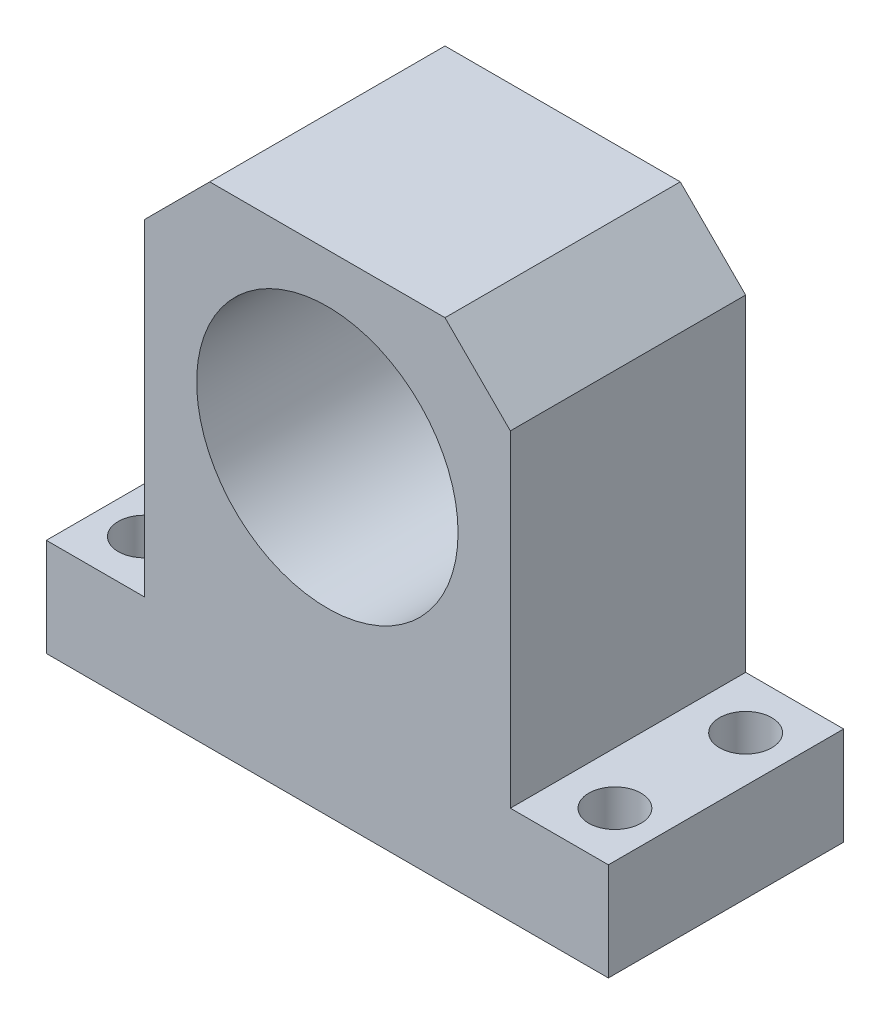
ISO-10303-21;
HEADER;
FILE_DESCRIPTION(('STEP AP214'),'2;1');
FILE_NAME('part.step','',(''),(''),'','','');
FILE_SCHEMA(('AUTOMOTIVE_DESIGN { 1 0 10303 214 1 1 1 1 }'));
ENDSEC;
DATA;
#1=APPLICATION_CONTEXT('core data for automotive mechanical design processes');
#2=APPLICATION_PROTOCOL_DEFINITION('international standard','automotive_design',2000,#1);
#3=PRODUCT_CONTEXT('',#1,'mechanical');
#4=PRODUCT('Part','Part','',(#3));
#5=PRODUCT_RELATED_PRODUCT_CATEGORY('part','',(#4));
#6=PRODUCT_DEFINITION_FORMATION('','',#4);
#7=PRODUCT_DEFINITION_CONTEXT('part definition',#1,'design');
#8=PRODUCT_DEFINITION('design','',#6,#7);
#9=PRODUCT_DEFINITION_SHAPE('','',#8);
#10=(LENGTH_UNIT() NAMED_UNIT(*) SI_UNIT(.MILLI.,.METRE.));
#11=(NAMED_UNIT(*) PLANE_ANGLE_UNIT() SI_UNIT($,.RADIAN.));
#12=(NAMED_UNIT(*) SI_UNIT($,.STERADIAN.) SOLID_ANGLE_UNIT());
#13=UNCERTAINTY_MEASURE_WITH_UNIT(LENGTH_MEASURE(1.E-05),#10,'distance_accuracy_value','');
#14=(GEOMETRIC_REPRESENTATION_CONTEXT(3) GLOBAL_UNCERTAINTY_ASSIGNED_CONTEXT((#13)) GLOBAL_UNIT_ASSIGNED_CONTEXT((#10,
#11,#12)) REPRESENTATION_CONTEXT('',''));
#15=CARTESIAN_POINT('',(0.,0.,0.));
#16=DIRECTION('',(0.,0.,1.));
#17=DIRECTION('',(1.,0.,0.));
#18=AXIS2_PLACEMENT_3D('',#15,#16,#17);
#19=CARTESIAN_POINT('',(0.,15.,36.));
#20=DIRECTION('',(1.,0.,0.));
#21=DIRECTION('',(0.,1.,0.));
#22=AXIS2_PLACEMENT_3D('',#19,#20,#21);
#23=PLANE('',#22);
#24=DIRECTION('',(0.,-1.,0.));
#25=VECTOR('',#24,1.);
#26=CARTESIAN_POINT('',(0.,15.,0.));
#27=LINE('',#26,#25);
#28=CARTESIAN_POINT('',(0.,15.,0.));
#29=VERTEX_POINT('',#28);
#30=CARTESIAN_POINT('',(0.,0.,0.));
#31=VERTEX_POINT('',#30);
#32=EDGE_CURVE('E135',#29,#31,#27,.T.);
#33=ORIENTED_EDGE('',*,*,#32,.T.);
#34=DIRECTION('',(0.,0.,-1.));
#35=VECTOR('',#34,1.);
#36=CARTESIAN_POINT('',(0.,0.,36.));
#37=LINE('',#36,#35);
#38=CARTESIAN_POINT('',(0.,0.,36.));
#39=VERTEX_POINT('',#38);
#40=EDGE_CURVE('E117',#39,#31,#37,.T.);
#41=ORIENTED_EDGE('',*,*,#40,.F.);
#42=DIRECTION('',(0.,-1.,0.));
#43=VECTOR('',#42,1.);
#44=CARTESIAN_POINT('',(0.,15.,36.));
#45=LINE('',#44,#43);
#46=CARTESIAN_POINT('',(0.,15.,36.));
#47=VERTEX_POINT('',#46);
#48=EDGE_CURVE('E123',#47,#39,#45,.T.);
#49=ORIENTED_EDGE('',*,*,#48,.F.);
#50=DIRECTION('',(0.,0.,-1.));
#51=VECTOR('',#50,1.);
#52=CARTESIAN_POINT('',(0.,15.,36.));
#53=LINE('',#52,#51);
#54=EDGE_CURVE('E185',#47,#29,#53,.T.);
#55=ORIENTED_EDGE('',*,*,#54,.T.);
#56=EDGE_LOOP('',(#33,#41,#49,#55));
#57=FACE_BOUND('',#56,.T.);
#58=ADVANCED_FACE('F33',(#57),#23,.F.);
#59=CARTESIAN_POINT('',(0.,0.,36.));
#60=DIRECTION('',(0.,1.,0.));
#61=DIRECTION('',(0.,0.,1.));
#62=AXIS2_PLACEMENT_3D('',#59,#60,#61);
#63=PLANE('',#62);
#64=CARTESIAN_POINT('',(6.99999999999999,0.,8.));
#65=DIRECTION('',(0.,1.,0.));
#66=DIRECTION('',(0.,0.,1.));
#67=AXIS2_PLACEMENT_3D('',#64,#65,#66);
#68=CIRCLE('',#67,4.);
#69=CARTESIAN_POINT('',(6.99999999999999,0.,12.));
#70=VERTEX_POINT('',#69);
#71=EDGE_CURVE('E219',#70,#70,#68,.T.);
#72=ORIENTED_EDGE('',*,*,#71,.T.);
#73=EDGE_LOOP('',(#72));
#74=FACE_BOUND('',#73,.T.);
#75=CARTESIAN_POINT('',(79.,0.,28.));
#76=DIRECTION('',(0.,1.,0.));
#77=DIRECTION('',(0.,0.,1.));
#78=AXIS2_PLACEMENT_3D('',#75,#76,#77);
#79=CIRCLE('',#78,4.00000000000001);
#80=CARTESIAN_POINT('',(79.,0.,32.));
#81=VERTEX_POINT('',#80);
#82=EDGE_CURVE('E211',#81,#81,#79,.T.);
#83=ORIENTED_EDGE('',*,*,#82,.T.);
#84=EDGE_LOOP('',(#83));
#85=FACE_BOUND('',#84,.T.);
#86=CARTESIAN_POINT('',(6.99999999999999,0.,28.));
#87=DIRECTION('',(0.,1.,0.));
#88=DIRECTION('',(0.,0.,1.));
#89=AXIS2_PLACEMENT_3D('',#86,#87,#88);
#90=CIRCLE('',#89,4.);
#91=CARTESIAN_POINT('',(6.99999999999999,0.,32.));
#92=VERTEX_POINT('',#91);
#93=EDGE_CURVE('E222',#92,#92,#90,.T.);
#94=ORIENTED_EDGE('',*,*,#93,.T.);
#95=EDGE_LOOP('',(#94));
#96=FACE_BOUND('',#95,.T.);
#97=CARTESIAN_POINT('',(79.,0.,8.));
#98=DIRECTION('',(0.,1.,0.));
#99=DIRECTION('',(0.,0.,1.));
#100=AXIS2_PLACEMENT_3D('',#97,#98,#99);
#101=CIRCLE('',#100,4.00000000000001);
#102=CARTESIAN_POINT('',(79.,0.,12.));
#103=VERTEX_POINT('',#102);
#104=EDGE_CURVE('E216',#103,#103,#101,.T.);
#105=ORIENTED_EDGE('',*,*,#104,.T.);
#106=EDGE_LOOP('',(#105));
#107=FACE_BOUND('',#106,.T.);
#108=DIRECTION('',(1.,0.,0.));
#109=VECTOR('',#108,1.);
#110=CARTESIAN_POINT('',(0.,0.,0.));
#111=LINE('',#110,#109);
#112=CARTESIAN_POINT('',(86.,0.,0.));
#113=VERTEX_POINT('',#112);
#114=EDGE_CURVE('E198',#31,#113,#111,.T.);
#115=ORIENTED_EDGE('',*,*,#114,.T.);
#116=DIRECTION('',(0.,0.,-1.));
#117=VECTOR('',#116,1.);
#118=CARTESIAN_POINT('',(86.,0.,36.));
#119=LINE('',#118,#117);
#120=CARTESIAN_POINT('',(86.,0.,36.));
#121=VERTEX_POINT('',#120);
#122=EDGE_CURVE('E120',#121,#113,#119,.T.);
#123=ORIENTED_EDGE('',*,*,#122,.F.);
#124=DIRECTION('',(1.,0.,0.));
#125=VECTOR('',#124,1.);
#126=CARTESIAN_POINT('',(0.,0.,36.));
#127=LINE('',#126,#125);
#128=EDGE_CURVE('E113',#39,#121,#127,.T.);
#129=ORIENTED_EDGE('',*,*,#128,.F.);
#130=ORIENTED_EDGE('',*,*,#40,.T.);
#131=EDGE_LOOP('',(#115,#123,#129,#130));
#132=FACE_BOUND('',#131,.T.);
#133=ADVANCED_FACE('F115',(#74,#85,#96,#107,#132),#63,.F.);
#134=CARTESIAN_POINT('',(86.,0.,36.));
#135=DIRECTION('',(-1.,0.,0.));
#136=DIRECTION('',(0.,0.,1.));
#137=AXIS2_PLACEMENT_3D('',#134,#135,#136);
#138=PLANE('',#137);
#139=DIRECTION('',(0.,1.,0.));
#140=VECTOR('',#139,1.);
#141=CARTESIAN_POINT('',(86.,0.,0.));
#142=LINE('',#141,#140);
#143=CARTESIAN_POINT('',(86.,15.,0.));
#144=VERTEX_POINT('',#143);
#145=EDGE_CURVE('E179',#113,#144,#142,.T.);
#146=ORIENTED_EDGE('',*,*,#145,.T.);
#147=DIRECTION('',(0.,0.,-1.));
#148=VECTOR('',#147,1.);
#149=CARTESIAN_POINT('',(86.,15.,36.));
#150=LINE('',#149,#148);
#151=CARTESIAN_POINT('',(86.,15.,36.));
#152=VERTEX_POINT('',#151);
#153=EDGE_CURVE('E140',#152,#144,#150,.T.);
#154=ORIENTED_EDGE('',*,*,#153,.F.);
#155=DIRECTION('',(0.,1.,0.));
#156=VECTOR('',#155,1.);
#157=CARTESIAN_POINT('',(86.,0.,36.));
#158=LINE('',#157,#156);
#159=EDGE_CURVE('E122',#121,#152,#158,.T.);
#160=ORIENTED_EDGE('',*,*,#159,.F.);
#161=ORIENTED_EDGE('',*,*,#122,.T.);
#162=EDGE_LOOP('',(#146,#154,#160,#161));
#163=FACE_BOUND('',#162,.T.);
#164=ADVANCED_FACE('F266',(#163),#138,.F.);
#165=CARTESIAN_POINT('',(86.,15.,36.));
#166=DIRECTION('',(0.,-1.,0.));
#167=DIRECTION('',(1.,0.,0.));
#168=AXIS2_PLACEMENT_3D('',#165,#166,#167);
#169=PLANE('',#168);
#170=CARTESIAN_POINT('',(79.,15.,28.));
#171=DIRECTION('',(0.,1.,0.));
#172=DIRECTION('',(0.,0.,1.));
#173=AXIS2_PLACEMENT_3D('',#170,#171,#172);
#174=CIRCLE('',#173,4.00000000000001);
#175=CARTESIAN_POINT('',(79.,15.,32.));
#176=VERTEX_POINT('',#175);
#177=EDGE_CURVE('E229',#176,#176,#174,.T.);
#178=ORIENTED_EDGE('',*,*,#177,.F.);
#179=EDGE_LOOP('',(#178));
#180=FACE_BOUND('',#179,.T.);
#181=CARTESIAN_POINT('',(79.,15.,8.));
#182=DIRECTION('',(0.,1.,0.));
#183=DIRECTION('',(0.,0.,1.));
#184=AXIS2_PLACEMENT_3D('',#181,#182,#183);
#185=CIRCLE('',#184,4.00000000000001);
#186=CARTESIAN_POINT('',(79.,15.,12.));
#187=VERTEX_POINT('',#186);
#188=EDGE_CURVE('E225',#187,#187,#185,.T.);
#189=ORIENTED_EDGE('',*,*,#188,.F.);
#190=EDGE_LOOP('',(#189));
#191=FACE_BOUND('',#190,.T.);
#192=DIRECTION('',(-1.,0.,0.));
#193=VECTOR('',#192,1.);
#194=CARTESIAN_POINT('',(86.,15.,0.));
#195=LINE('',#194,#193);
#196=CARTESIAN_POINT('',(71.,15.,0.));
#197=VERTEX_POINT('',#196);
#198=EDGE_CURVE('E175',#144,#197,#195,.T.);
#199=ORIENTED_EDGE('',*,*,#198,.T.);
#200=DIRECTION('',(0.,0.,-1.));
#201=VECTOR('',#200,1.);
#202=CARTESIAN_POINT('',(71.,15.,36.));
#203=LINE('',#202,#201);
#204=CARTESIAN_POINT('',(71.,15.,36.));
#205=VERTEX_POINT('',#204);
#206=EDGE_CURVE('E174',#205,#197,#203,.T.);
#207=ORIENTED_EDGE('',*,*,#206,.F.);
#208=DIRECTION('',(-1.,0.,0.));
#209=VECTOR('',#208,1.);
#210=CARTESIAN_POINT('',(86.,15.,36.));
#211=LINE('',#210,#209);
#212=EDGE_CURVE('E195',#152,#205,#211,.T.);
#213=ORIENTED_EDGE('',*,*,#212,.F.);
#214=ORIENTED_EDGE('',*,*,#153,.T.);
#215=EDGE_LOOP('',(#199,#207,#213,#214));
#216=FACE_BOUND('',#215,.T.);
#217=ADVANCED_FACE('F194',(#180,#191,#216),#169,.F.);
#218=CARTESIAN_POINT('',(71.,15.,36.));
#219=DIRECTION('',(-1.,0.,0.));
#220=DIRECTION('',(0.,0.,1.));
#221=AXIS2_PLACEMENT_3D('',#218,#219,#220);
#222=PLANE('',#221);
#223=DIRECTION('',(0.,1.,0.));
#224=VECTOR('',#223,1.);
#225=CARTESIAN_POINT('',(71.,15.,0.));
#226=LINE('',#225,#224);
#227=CARTESIAN_POINT('',(71.,65.,0.));
#228=VERTEX_POINT('',#227);
#229=EDGE_CURVE('E169',#197,#228,#226,.T.);
#230=ORIENTED_EDGE('',*,*,#229,.T.);
#231=DIRECTION('',(0.,0.,1.));
#232=VECTOR('',#231,1.);
#233=CARTESIAN_POINT('',(71.,65.,36.));
#234=LINE('',#233,#232);
#235=CARTESIAN_POINT('',(71.,65.,36.));
#236=VERTEX_POINT('',#235);
#237=EDGE_CURVE('E56',#228,#236,#234,.T.);
#238=ORIENTED_EDGE('',*,*,#237,.T.);
#239=DIRECTION('',(0.,1.,0.));
#240=VECTOR('',#239,1.);
#241=CARTESIAN_POINT('',(71.,15.,36.));
#242=LINE('',#241,#240);
#243=EDGE_CURVE('E154',#205,#236,#242,.T.);
#244=ORIENTED_EDGE('',*,*,#243,.F.);
#245=ORIENTED_EDGE('',*,*,#206,.T.);
#246=EDGE_LOOP('',(#230,#238,#244,#245));
#247=FACE_BOUND('',#246,.T.);
#248=ADVANCED_FACE('F172',(#247),#222,.F.);
#249=CARTESIAN_POINT('',(71.,75.,36.));
#250=DIRECTION('',(0.,-1.,0.));
#251=DIRECTION('',(1.,0.,0.));
#252=AXIS2_PLACEMENT_3D('',#249,#250,#251);
#253=PLANE('',#252);
#254=DIRECTION('',(-1.,0.,0.));
#255=VECTOR('',#254,1.);
#256=CARTESIAN_POINT('',(71.,75.,36.));
#257=LINE('',#256,#255);
#258=CARTESIAN_POINT('',(61.,75.,36.));
#259=VERTEX_POINT('',#258);
#260=CARTESIAN_POINT('',(25.,75.,36.));
#261=VERTEX_POINT('',#260);
#262=EDGE_CURVE('E153',#259,#261,#257,.T.);
#263=ORIENTED_EDGE('',*,*,#262,.F.);
#264=DIRECTION('',(0.,0.,-1.));
#265=VECTOR('',#264,1.);
#266=CARTESIAN_POINT('',(61.,75.,36.));
#267=LINE('',#266,#265);
#268=CARTESIAN_POINT('',(61.,75.,0.));
#269=VERTEX_POINT('',#268);
#270=EDGE_CURVE('E138',#259,#269,#267,.T.);
#271=ORIENTED_EDGE('',*,*,#270,.T.);
#272=DIRECTION('',(-1.,0.,0.));
#273=VECTOR('',#272,1.);
#274=CARTESIAN_POINT('',(71.,75.,0.));
#275=LINE('',#274,#273);
#276=CARTESIAN_POINT('',(25.,75.,0.));
#277=VERTEX_POINT('',#276);
#278=EDGE_CURVE('E170',#269,#277,#275,.T.);
#279=ORIENTED_EDGE('',*,*,#278,.T.);
#280=DIRECTION('',(0.,0.,1.));
#281=VECTOR('',#280,1.);
#282=CARTESIAN_POINT('',(25.,75.,36.));
#283=LINE('',#282,#281);
#284=EDGE_CURVE('E136',#277,#261,#283,.T.);
#285=ORIENTED_EDGE('',*,*,#284,.T.);
#286=EDGE_LOOP('',(#263,#271,#279,#285));
#287=FACE_BOUND('',#286,.T.);
#288=ADVANCED_FACE('F158',(#287),#253,.F.);
#289=CARTESIAN_POINT('',(15.,75.,36.));
#290=DIRECTION('',(1.,0.,0.));
#291=DIRECTION('',(0.,1.,0.));
#292=AXIS2_PLACEMENT_3D('',#289,#290,#291);
#293=PLANE('',#292);
#294=DIRECTION('',(0.,-1.,0.));
#295=VECTOR('',#294,1.);
#296=CARTESIAN_POINT('',(15.,75.,36.));
#297=LINE('',#296,#295);
#298=CARTESIAN_POINT('',(15.,65.,36.));
#299=VERTEX_POINT('',#298);
#300=CARTESIAN_POINT('',(15.,15.,36.));
#301=VERTEX_POINT('',#300);
#302=EDGE_CURVE('E162',#299,#301,#297,.T.);
#303=ORIENTED_EDGE('',*,*,#302,.F.);
#304=DIRECTION('',(0.,0.,-1.));
#305=VECTOR('',#304,1.);
#306=CARTESIAN_POINT('',(15.,65.,36.));
#307=LINE('',#306,#305);
#308=CARTESIAN_POINT('',(15.,65.,0.));
#309=VERTEX_POINT('',#308);
#310=EDGE_CURVE('E11',#299,#309,#307,.T.);
#311=ORIENTED_EDGE('',*,*,#310,.T.);
#312=DIRECTION('',(0.,-1.,0.));
#313=VECTOR('',#312,1.);
#314=CARTESIAN_POINT('',(15.,75.,0.));
#315=LINE('',#314,#313);
#316=CARTESIAN_POINT('',(15.,15.,0.));
#317=VERTEX_POINT('',#316);
#318=EDGE_CURVE('E177',#309,#317,#315,.T.);
#319=ORIENTED_EDGE('',*,*,#318,.T.);
#320=DIRECTION('',(0.,0.,-1.));
#321=VECTOR('',#320,1.);
#322=CARTESIAN_POINT('',(15.,15.,36.));
#323=LINE('',#322,#321);
#324=EDGE_CURVE('E187',#301,#317,#323,.T.);
#325=ORIENTED_EDGE('',*,*,#324,.F.);
#326=EDGE_LOOP('',(#303,#311,#319,#325));
#327=FACE_BOUND('',#326,.T.);
#328=ADVANCED_FACE('F244',(#327),#293,.F.);
#329=CARTESIAN_POINT('',(15.,15.,36.));
#330=DIRECTION('',(0.,-1.,0.));
#331=DIRECTION('',(1.,0.,0.));
#332=AXIS2_PLACEMENT_3D('',#329,#330,#331);
#333=PLANE('',#332);
#334=CARTESIAN_POINT('',(6.99999999999999,15.,8.));
#335=DIRECTION('',(0.,1.,0.));
#336=DIRECTION('',(0.,0.,1.));
#337=AXIS2_PLACEMENT_3D('',#334,#335,#336);
#338=CIRCLE('',#337,4.);
#339=CARTESIAN_POINT('',(6.99999999999999,15.,12.));
#340=VERTEX_POINT('',#339);
#341=EDGE_CURVE('E228',#340,#340,#338,.T.);
#342=ORIENTED_EDGE('',*,*,#341,.F.);
#343=EDGE_LOOP('',(#342));
#344=FACE_BOUND('',#343,.T.);
#345=CARTESIAN_POINT('',(6.99999999999999,15.,28.));
#346=DIRECTION('',(0.,1.,0.));
#347=DIRECTION('',(0.,0.,1.));
#348=AXIS2_PLACEMENT_3D('',#345,#346,#347);
#349=CIRCLE('',#348,4.);
#350=CARTESIAN_POINT('',(6.99999999999999,15.,32.));
#351=VERTEX_POINT('',#350);
#352=EDGE_CURVE('E232',#351,#351,#349,.T.);
#353=ORIENTED_EDGE('',*,*,#352,.F.);
#354=EDGE_LOOP('',(#353));
#355=FACE_BOUND('',#354,.T.);
#356=DIRECTION('',(-1.,0.,0.));
#357=VECTOR('',#356,1.);
#358=CARTESIAN_POINT('',(15.,15.,0.));
#359=LINE('',#358,#357);
#360=EDGE_CURVE('E132',#317,#29,#359,.T.);
#361=ORIENTED_EDGE('',*,*,#360,.T.);
#362=ORIENTED_EDGE('',*,*,#54,.F.);
#363=DIRECTION('',(-1.,0.,0.));
#364=VECTOR('',#363,1.);
#365=CARTESIAN_POINT('',(15.,15.,36.));
#366=LINE('',#365,#364);
#367=EDGE_CURVE('E128',#301,#47,#366,.T.);
#368=ORIENTED_EDGE('',*,*,#367,.F.);
#369=ORIENTED_EDGE('',*,*,#324,.T.);
#370=EDGE_LOOP('',(#361,#362,#368,#369));
#371=FACE_BOUND('',#370,.T.);
#372=ADVANCED_FACE('F241',(#344,#355,#371),#333,.F.);
#373=CARTESIAN_POINT('',(0.,0.,36.));
#374=DIRECTION('',(0.,0.,1.));
#375=DIRECTION('',(1.,0.,0.));
#376=AXIS2_PLACEMENT_3D('',#373,#374,#375);
#377=PLANE('',#376);
#378=CARTESIAN_POINT('',(43.,47.5,36.));
#379=DIRECTION('',(0.,0.,1.));
#380=DIRECTION('',(1.,0.,0.));
#381=AXIS2_PLACEMENT_3D('',#378,#379,#380);
#382=CIRCLE('',#381,20.);
#383=CARTESIAN_POINT('',(63.,47.5,36.));
#384=VERTEX_POINT('',#383);
#385=EDGE_CURVE('E208',#384,#384,#382,.T.);
#386=ORIENTED_EDGE('',*,*,#385,.F.);
#387=EDGE_LOOP('',(#386));
#388=FACE_BOUND('',#387,.T.);
#389=ORIENTED_EDGE('',*,*,#243,.T.);
#390=DIRECTION('',(0.707106781186546,-0.70710678118655,0.));
#391=VECTOR('',#390,1.);
#392=CARTESIAN_POINT('',(68.0000000000002,67.9999999999998,36.));
#393=LINE('',#392,#391);
#394=EDGE_CURVE('E41',#236,#259,#393,.F.);
#395=ORIENTED_EDGE('',*,*,#394,.T.);
#396=ORIENTED_EDGE('',*,*,#262,.T.);
#397=DIRECTION('',(0.707106781186548,0.707106781186547,0.));
#398=VECTOR('',#397,1.);
#399=CARTESIAN_POINT('',(-25.,25.0000000000001,36.));
#400=LINE('',#399,#398);
#401=EDGE_CURVE('E48',#261,#299,#400,.F.);
#402=ORIENTED_EDGE('',*,*,#401,.T.);
#403=ORIENTED_EDGE('',*,*,#302,.T.);
#404=ORIENTED_EDGE('',*,*,#367,.T.);
#405=ORIENTED_EDGE('',*,*,#48,.T.);
#406=ORIENTED_EDGE('',*,*,#128,.T.);
#407=ORIENTED_EDGE('',*,*,#159,.T.);
#408=ORIENTED_EDGE('',*,*,#212,.T.);
#409=EDGE_LOOP('',(#389,#395,#396,#402,#403,#404,#405,#406,#407,#408));
#410=FACE_BOUND('',#409,.T.);
#411=ADVANCED_FACE('F126',(#388,#410),#377,.T.);
#412=CARTESIAN_POINT('',(0.,0.,0.));
#413=DIRECTION('',(0.,0.,1.));
#414=DIRECTION('',(1.,0.,0.));
#415=AXIS2_PLACEMENT_3D('',#412,#413,#414);
#416=PLANE('',#415);
#417=CARTESIAN_POINT('',(43.,47.5,0.));
#418=DIRECTION('',(0.,0.,1.));
#419=DIRECTION('',(1.,0.,0.));
#420=AXIS2_PLACEMENT_3D('',#417,#418,#419);
#421=CIRCLE('',#420,20.);
#422=CARTESIAN_POINT('',(63.,47.5,0.));
#423=VERTEX_POINT('',#422);
#424=EDGE_CURVE('E202',#423,#423,#421,.T.);
#425=ORIENTED_EDGE('',*,*,#424,.T.);
#426=EDGE_LOOP('',(#425));
#427=FACE_BOUND('',#426,.T.);
#428=ORIENTED_EDGE('',*,*,#278,.F.);
#429=DIRECTION('',(-0.707106781186546,0.70710678118655,0.));
#430=VECTOR('',#429,1.);
#431=CARTESIAN_POINT('',(61.,75.,0.));
#432=LINE('',#431,#430);
#433=EDGE_CURVE('E148',#269,#228,#432,.F.);
#434=ORIENTED_EDGE('',*,*,#433,.T.);
#435=ORIENTED_EDGE('',*,*,#229,.F.);
#436=ORIENTED_EDGE('',*,*,#198,.F.);
#437=ORIENTED_EDGE('',*,*,#145,.F.);
#438=ORIENTED_EDGE('',*,*,#114,.F.);
#439=ORIENTED_EDGE('',*,*,#32,.F.);
#440=ORIENTED_EDGE('',*,*,#360,.F.);
#441=ORIENTED_EDGE('',*,*,#318,.F.);
#442=DIRECTION('',(-0.707106781186548,-0.707106781186547,0.));
#443=VECTOR('',#442,1.);
#444=CARTESIAN_POINT('',(15.,65.,0.));
#445=LINE('',#444,#443);
#446=EDGE_CURVE('E146',#309,#277,#445,.F.);
#447=ORIENTED_EDGE('',*,*,#446,.T.);
#448=EDGE_LOOP('',(#428,#434,#435,#436,#437,#438,#439,#440,#441,#447));
#449=FACE_BOUND('',#448,.T.);
#450=ADVANCED_FACE('F167',(#427,#449),#416,.F.);
#451=CARTESIAN_POINT('',(43.,47.5,0.));
#452=DIRECTION('',(0.,0.,1.));
#453=DIRECTION('',(1.,0.,0.));
#454=AXIS2_PLACEMENT_3D('',#451,#452,#453);
#455=CYLINDRICAL_SURFACE('',#454,20.);
#456=ORIENTED_EDGE('',*,*,#424,.F.);
#457=EDGE_LOOP('',(#456));
#458=FACE_BOUND('',#457,.T.);
#459=ORIENTED_EDGE('',*,*,#385,.T.);
#460=EDGE_LOOP('',(#459));
#461=FACE_BOUND('',#460,.T.);
#462=ADVANCED_FACE('F260',(#458,#461),#455,.F.);
#463=CARTESIAN_POINT('',(61.,75.,36.));
#464=DIRECTION('',(-0.70710678118655,-0.707106781186546,0.));
#465=DIRECTION('',(0.,0.,-1.));
#466=AXIS2_PLACEMENT_3D('',#463,#464,#465);
#467=PLANE('',#466);
#468=ORIENTED_EDGE('',*,*,#394,.F.);
#469=ORIENTED_EDGE('',*,*,#237,.F.);
#470=ORIENTED_EDGE('',*,*,#433,.F.);
#471=ORIENTED_EDGE('',*,*,#270,.F.);
#472=EDGE_LOOP('',(#468,#469,#470,#471));
#473=FACE_BOUND('',#472,.T.);
#474=ADVANCED_FACE('F164',(#473),#467,.F.);
#475=CARTESIAN_POINT('',(15.,65.,36.));
#476=DIRECTION('',(0.707106781186547,-0.707106781186548,0.));
#477=DIRECTION('',(0.,0.,-1.));
#478=AXIS2_PLACEMENT_3D('',#475,#476,#477);
#479=PLANE('',#478);
#480=ORIENTED_EDGE('',*,*,#401,.F.);
#481=ORIENTED_EDGE('',*,*,#284,.F.);
#482=ORIENTED_EDGE('',*,*,#446,.F.);
#483=ORIENTED_EDGE('',*,*,#310,.F.);
#484=EDGE_LOOP('',(#480,#481,#482,#483));
#485=FACE_BOUND('',#484,.T.);
#486=ADVANCED_FACE('F35',(#485),#479,.F.);
#487=CARTESIAN_POINT('',(6.99999999999999,-3.,28.));
#488=DIRECTION('',(0.,1.,0.));
#489=DIRECTION('',(0.,0.,1.));
#490=AXIS2_PLACEMENT_3D('',#487,#488,#489);
#491=CYLINDRICAL_SURFACE('',#490,4.);
#492=ORIENTED_EDGE('',*,*,#352,.T.);
#493=EDGE_LOOP('',(#492));
#494=FACE_BOUND('',#493,.T.);
#495=ORIENTED_EDGE('',*,*,#93,.F.);
#496=EDGE_LOOP('',(#495));
#497=FACE_BOUND('',#496,.T.);
#498=ADVANCED_FACE('F238',(#494,#497),#491,.F.);
#499=CARTESIAN_POINT('',(6.99999999999999,-3.,8.));
#500=DIRECTION('',(0.,1.,0.));
#501=DIRECTION('',(0.,0.,1.));
#502=AXIS2_PLACEMENT_3D('',#499,#500,#501);
#503=CYLINDRICAL_SURFACE('',#502,4.);
#504=ORIENTED_EDGE('',*,*,#341,.T.);
#505=EDGE_LOOP('',(#504));
#506=FACE_BOUND('',#505,.T.);
#507=ORIENTED_EDGE('',*,*,#71,.F.);
#508=EDGE_LOOP('',(#507));
#509=FACE_BOUND('',#508,.T.);
#510=ADVANCED_FACE('F258',(#506,#509),#503,.F.);
#511=CARTESIAN_POINT('',(79.,-3.,8.));
#512=DIRECTION('',(0.,1.,0.));
#513=DIRECTION('',(0.,0.,1.));
#514=AXIS2_PLACEMENT_3D('',#511,#512,#513);
#515=CYLINDRICAL_SURFACE('',#514,4.00000000000001);
#516=ORIENTED_EDGE('',*,*,#188,.T.);
#517=EDGE_LOOP('',(#516));
#518=FACE_BOUND('',#517,.T.);
#519=ORIENTED_EDGE('',*,*,#104,.F.);
#520=EDGE_LOOP('',(#519));
#521=FACE_BOUND('',#520,.T.);
#522=ADVANCED_FACE('F290',(#518,#521),#515,.F.);
#523=CARTESIAN_POINT('',(79.,-3.,28.));
#524=DIRECTION('',(0.,1.,0.));
#525=DIRECTION('',(0.,0.,1.));
#526=AXIS2_PLACEMENT_3D('',#523,#524,#525);
#527=CYLINDRICAL_SURFACE('',#526,4.00000000000001);
#528=ORIENTED_EDGE('',*,*,#177,.T.);
#529=EDGE_LOOP('',(#528));
#530=FACE_BOUND('',#529,.T.);
#531=ORIENTED_EDGE('',*,*,#82,.F.);
#532=EDGE_LOOP('',(#531));
#533=FACE_BOUND('',#532,.T.);
#534=ADVANCED_FACE('F293',(#530,#533),#527,.F.);
#535=CLOSED_SHELL('',(#58,#133,#164,#217,#248,#288,#328,#372,#411,#450,#462,#474,#486,#498,#510,
#522,#534));
#536=MANIFOLD_SOLID_BREP('B2',#535);
#537=ADVANCED_BREP_SHAPE_REPRESENTATION('',(#18,#536),#14);
#538=SHAPE_DEFINITION_REPRESENTATION(#9,#537);
ENDSEC;
END-ISO-10303-21;
